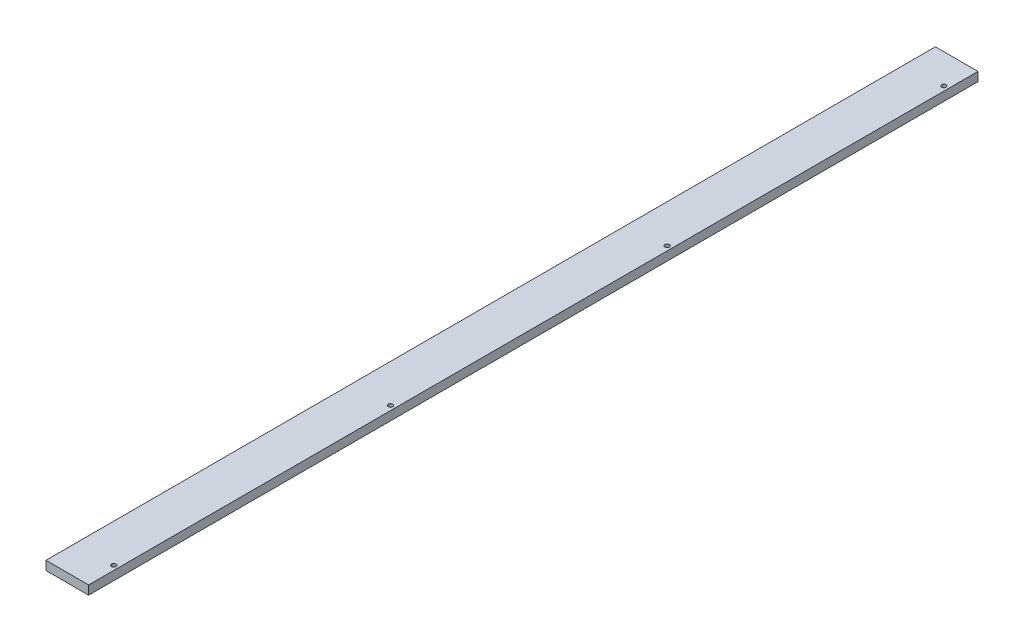
ISO-10303-21;
HEADER;
FILE_DESCRIPTION(('STEP AP214'),'2;1');
FILE_NAME('part.step','',(''),(''),'','','');
FILE_SCHEMA(('AUTOMOTIVE_DESIGN { 1 0 10303 214 1 1 1 1 }'));
ENDSEC;
DATA;
#1=APPLICATION_CONTEXT('core data for automotive mechanical design processes');
#2=APPLICATION_PROTOCOL_DEFINITION('international standard','automotive_design',2000,#1);
#3=PRODUCT_CONTEXT('',#1,'mechanical');
#4=PRODUCT('Part','Part','',(#3));
#5=PRODUCT_RELATED_PRODUCT_CATEGORY('part','',(#4));
#6=PRODUCT_DEFINITION_FORMATION('','',#4);
#7=PRODUCT_DEFINITION_CONTEXT('part definition',#1,'design');
#8=PRODUCT_DEFINITION('design','',#6,#7);
#9=PRODUCT_DEFINITION_SHAPE('','',#8);
#10=(LENGTH_UNIT() NAMED_UNIT(*) SI_UNIT(.MILLI.,.METRE.));
#11=(NAMED_UNIT(*) PLANE_ANGLE_UNIT() SI_UNIT($,.RADIAN.));
#12=(NAMED_UNIT(*) SI_UNIT($,.STERADIAN.) SOLID_ANGLE_UNIT());
#13=UNCERTAINTY_MEASURE_WITH_UNIT(LENGTH_MEASURE(1.E-05),#10,'distance_accuracy_value','');
#14=(GEOMETRIC_REPRESENTATION_CONTEXT(3) GLOBAL_UNCERTAINTY_ASSIGNED_CONTEXT((#13)) GLOBAL_UNIT_ASSIGNED_CONTEXT((#10,
#11,#12)) REPRESENTATION_CONTEXT('',''));
#15=CARTESIAN_POINT('',(0.,0.,0.));
#16=DIRECTION('',(0.,0.,1.));
#17=DIRECTION('',(1.,0.,0.));
#18=AXIS2_PLACEMENT_3D('',#15,#16,#17);
#19=CARTESIAN_POINT('',(0.,12.,0.));
#20=DIRECTION('',(0.,0.,-1.));
#21=DIRECTION('',(-1.,0.,0.));
#22=AXIS2_PLACEMENT_3D('',#19,#20,#21);
#23=PLANE('',#22);
#24=DIRECTION('',(1.,0.,0.));
#25=VECTOR('',#24,1.);
#26=CARTESIAN_POINT('',(0.,12.,0.));
#27=LINE('',#26,#25);
#28=CARTESIAN_POINT('',(4.5,12.,0.));
#29=VERTEX_POINT('',#28);
#30=CARTESIAN_POINT('',(62.,12.,0.));
#31=VERTEX_POINT('',#30);
#32=EDGE_CURVE('E88',#29,#31,#27,.T.);
#33=ORIENTED_EDGE('',*,*,#32,.F.);
#34=DIRECTION('',(0.,1.,0.));
#35=VECTOR('',#34,1.);
#36=CARTESIAN_POINT('',(4.5,-8.,0.));
#37=LINE('',#36,#35);
#38=CARTESIAN_POINT('',(4.5,0.,0.));
#39=VERTEX_POINT('',#38);
#40=EDGE_CURVE('E116',#39,#29,#37,.T.);
#41=ORIENTED_EDGE('',*,*,#40,.F.);
#42=DIRECTION('',(1.,0.,0.));
#43=VECTOR('',#42,1.);
#44=CARTESIAN_POINT('',(0.,0.,0.));
#45=LINE('',#44,#43);
#46=CARTESIAN_POINT('',(62.,0.,0.));
#47=VERTEX_POINT('',#46);
#48=EDGE_CURVE('E79',#39,#47,#45,.T.);
#49=ORIENTED_EDGE('',*,*,#48,.T.);
#50=DIRECTION('',(0.,-1.,0.));
#51=VECTOR('',#50,1.);
#52=CARTESIAN_POINT('',(62.,12.,0.));
#53=LINE('',#52,#51);
#54=EDGE_CURVE('E41',#31,#47,#53,.T.);
#55=ORIENTED_EDGE('',*,*,#54,.F.);
#56=EDGE_LOOP('',(#33,#41,#49,#55));
#57=FACE_BOUND('',#56,.T.);
#58=ADVANCED_FACE('F34',(#57),#23,.F.);
#59=CARTESIAN_POINT('',(62.,12.,0.));
#60=DIRECTION('',(-1.,0.,0.));
#61=DIRECTION('',(0.,0.,1.));
#62=AXIS2_PLACEMENT_3D('',#59,#60,#61);
#63=PLANE('',#62);
#64=DIRECTION('',(0.,0.,-1.));
#65=VECTOR('',#64,1.);
#66=CARTESIAN_POINT('',(62.,0.,0.));
#67=LINE('',#66,#65);
#68=CARTESIAN_POINT('',(62.,0.,-1200.));
#69=VERTEX_POINT('',#68);
#70=EDGE_CURVE('E69',#47,#69,#67,.T.);
#71=ORIENTED_EDGE('',*,*,#70,.T.);
#72=DIRECTION('',(0.,-1.,0.));
#73=VECTOR('',#72,1.);
#74=CARTESIAN_POINT('',(62.,12.,-1200.));
#75=LINE('',#74,#73);
#76=CARTESIAN_POINT('',(62.,12.,-1200.));
#77=VERTEX_POINT('',#76);
#78=EDGE_CURVE('E72',#77,#69,#75,.T.);
#79=ORIENTED_EDGE('',*,*,#78,.F.);
#80=DIRECTION('',(0.,0.,-1.));
#81=VECTOR('',#80,1.);
#82=CARTESIAN_POINT('',(62.,12.,0.));
#83=LINE('',#82,#81);
#84=EDGE_CURVE('E56',#31,#77,#83,.T.);
#85=ORIENTED_EDGE('',*,*,#84,.F.);
#86=ORIENTED_EDGE('',*,*,#54,.T.);
#87=EDGE_LOOP('',(#71,#79,#85,#86));
#88=FACE_BOUND('',#87,.T.);
#89=ADVANCED_FACE('F71',(#88),#63,.F.);
#90=CARTESIAN_POINT('',(0.,12.,-1200.));
#91=DIRECTION('',(0.,0.,1.));
#92=DIRECTION('',(1.,0.,0.));
#93=AXIS2_PLACEMENT_3D('',#90,#91,#92);
#94=PLANE('',#93);
#95=DIRECTION('',(-1.,0.,0.));
#96=VECTOR('',#95,1.);
#97=CARTESIAN_POINT('',(0.,0.,-1200.));
#98=LINE('',#97,#96);
#99=CARTESIAN_POINT('',(4.5,0.,-1200.));
#100=VERTEX_POINT('',#99);
#101=EDGE_CURVE('E78',#69,#100,#98,.T.);
#102=ORIENTED_EDGE('',*,*,#101,.T.);
#103=DIRECTION('',(0.,1.,0.));
#104=VECTOR('',#103,1.);
#105=CARTESIAN_POINT('',(4.5,12.,-1200.));
#106=LINE('',#105,#104);
#107=CARTESIAN_POINT('',(4.5,12.,-1200.));
#108=VERTEX_POINT('',#107);
#109=EDGE_CURVE('E47',#100,#108,#106,.T.);
#110=ORIENTED_EDGE('',*,*,#109,.T.);
#111=DIRECTION('',(-1.,0.,0.));
#112=VECTOR('',#111,1.);
#113=CARTESIAN_POINT('',(0.,12.,-1200.));
#114=LINE('',#113,#112);
#115=EDGE_CURVE('E84',#77,#108,#114,.T.);
#116=ORIENTED_EDGE('',*,*,#115,.F.);
#117=ORIENTED_EDGE('',*,*,#78,.T.);
#118=EDGE_LOOP('',(#102,#110,#116,#117));
#119=FACE_BOUND('',#118,.T.);
#120=ADVANCED_FACE('F83',(#119),#94,.F.);
#121=CARTESIAN_POINT('',(0.,12.,-1200.));
#122=DIRECTION('',(0.,-1.,0.));
#123=DIRECTION('',(0.,0.,-1.));
#124=AXIS2_PLACEMENT_3D('',#121,#122,#123);
#125=PLANE('',#124);
#126=CARTESIAN_POINT('',(56.,12.,-1160.));
#127=DIRECTION('',(0.,1.,0.));
#128=DIRECTION('',(0.,0.,1.));
#129=AXIS2_PLACEMENT_3D('',#126,#127,#128);
#130=CIRCLE('',#129,3.);
#131=CARTESIAN_POINT('',(56.,12.,-1157.));
#132=VERTEX_POINT('',#131);
#133=EDGE_CURVE('E107',#132,#132,#130,.T.);
#134=ORIENTED_EDGE('',*,*,#133,.F.);
#135=EDGE_LOOP('',(#134));
#136=FACE_BOUND('',#135,.T.);
#137=CARTESIAN_POINT('',(56.,12.,-786.666666666667));
#138=DIRECTION('',(0.,1.,0.));
#139=DIRECTION('',(0.,0.,1.));
#140=AXIS2_PLACEMENT_3D('',#137,#138,#139);
#141=CIRCLE('',#140,3.);
#142=CARTESIAN_POINT('',(56.,12.,-783.666666666667));
#143=VERTEX_POINT('',#142);
#144=EDGE_CURVE('E104',#143,#143,#141,.T.);
#145=ORIENTED_EDGE('',*,*,#144,.F.);
#146=EDGE_LOOP('',(#145));
#147=FACE_BOUND('',#146,.T.);
#148=CARTESIAN_POINT('',(56.,12.,-413.333333333333));
#149=DIRECTION('',(0.,1.,0.));
#150=DIRECTION('',(0.,0.,1.));
#151=AXIS2_PLACEMENT_3D('',#148,#149,#150);
#152=CIRCLE('',#151,3.);
#153=CARTESIAN_POINT('',(56.,12.,-410.333333333333));
#154=VERTEX_POINT('',#153);
#155=EDGE_CURVE('E101',#154,#154,#152,.T.);
#156=ORIENTED_EDGE('',*,*,#155,.F.);
#157=EDGE_LOOP('',(#156));
#158=FACE_BOUND('',#157,.T.);
#159=CARTESIAN_POINT('',(56.,12.,-40.));
#160=DIRECTION('',(0.,1.,0.));
#161=DIRECTION('',(0.,0.,1.));
#162=AXIS2_PLACEMENT_3D('',#159,#160,#161);
#163=CIRCLE('',#162,3.);
#164=CARTESIAN_POINT('',(56.,12.,-37.));
#165=VERTEX_POINT('',#164);
#166=EDGE_CURVE('E97',#165,#165,#163,.T.);
#167=ORIENTED_EDGE('',*,*,#166,.F.);
#168=EDGE_LOOP('',(#167));
#169=FACE_BOUND('',#168,.T.);
#170=ORIENTED_EDGE('',*,*,#115,.T.);
#171=DIRECTION('',(0.,0.,-1.));
#172=VECTOR('',#171,1.);
#173=CARTESIAN_POINT('',(4.5,12.,0.));
#174=LINE('',#173,#172);
#175=EDGE_CURVE('E135',#29,#108,#174,.T.);
#176=ORIENTED_EDGE('',*,*,#175,.F.);
#177=ORIENTED_EDGE('',*,*,#32,.T.);
#178=ORIENTED_EDGE('',*,*,#84,.T.);
#179=EDGE_LOOP('',(#170,#176,#177,#178));
#180=FACE_BOUND('',#179,.T.);
#181=ADVANCED_FACE('F136',(#136,#147,#158,#169,#180),#125,.F.);
#182=CARTESIAN_POINT('',(0.,0.,-1200.));
#183=DIRECTION('',(0.,-1.,0.));
#184=DIRECTION('',(0.,0.,-1.));
#185=AXIS2_PLACEMENT_3D('',#182,#183,#184);
#186=PLANE('',#185);
#187=DIRECTION('',(0.,0.,1.));
#188=VECTOR('',#187,1.);
#189=CARTESIAN_POINT('',(4.5,0.,-1200.));
#190=LINE('',#189,#188);
#191=EDGE_CURVE('E11',#100,#39,#190,.T.);
#192=ORIENTED_EDGE('',*,*,#191,.F.);
#193=ORIENTED_EDGE('',*,*,#101,.F.);
#194=ORIENTED_EDGE('',*,*,#70,.F.);
#195=ORIENTED_EDGE('',*,*,#48,.F.);
#196=EDGE_LOOP('',(#192,#193,#194,#195));
#197=FACE_BOUND('',#196,.T.);
#198=CARTESIAN_POINT('',(56.,0.,-1160.));
#199=DIRECTION('',(0.,-1.,0.));
#200=DIRECTION('',(0.,0.,-1.));
#201=AXIS2_PLACEMENT_3D('',#198,#199,#200);
#202=CIRCLE('',#201,3.);
#203=CARTESIAN_POINT('',(56.,0.,-1163.));
#204=VERTEX_POINT('',#203);
#205=EDGE_CURVE('E105',#204,#204,#202,.T.);
#206=ORIENTED_EDGE('',*,*,#205,.F.);
#207=EDGE_LOOP('',(#206));
#208=FACE_BOUND('',#207,.T.);
#209=CARTESIAN_POINT('',(56.,0.,-786.666666666667));
#210=DIRECTION('',(0.,-1.,0.));
#211=DIRECTION('',(0.,0.,-1.));
#212=AXIS2_PLACEMENT_3D('',#209,#210,#211);
#213=CIRCLE('',#212,3.);
#214=CARTESIAN_POINT('',(56.,0.,-789.666666666667));
#215=VERTEX_POINT('',#214);
#216=EDGE_CURVE('E102',#215,#215,#213,.T.);
#217=ORIENTED_EDGE('',*,*,#216,.F.);
#218=EDGE_LOOP('',(#217));
#219=FACE_BOUND('',#218,.T.);
#220=CARTESIAN_POINT('',(56.,0.,-413.333333333333));
#221=DIRECTION('',(0.,-1.,0.));
#222=DIRECTION('',(0.,0.,-1.));
#223=AXIS2_PLACEMENT_3D('',#220,#221,#222);
#224=CIRCLE('',#223,3.);
#225=CARTESIAN_POINT('',(56.,0.,-416.333333333333));
#226=VERTEX_POINT('',#225);
#227=EDGE_CURVE('E98',#226,#226,#224,.T.);
#228=ORIENTED_EDGE('',*,*,#227,.F.);
#229=EDGE_LOOP('',(#228));
#230=FACE_BOUND('',#229,.T.);
#231=CARTESIAN_POINT('',(56.,0.,-40.));
#232=DIRECTION('',(0.,-1.,0.));
#233=DIRECTION('',(0.,0.,-1.));
#234=AXIS2_PLACEMENT_3D('',#231,#232,#233);
#235=CIRCLE('',#234,3.);
#236=CARTESIAN_POINT('',(56.,0.,-43.));
#237=VERTEX_POINT('',#236);
#238=EDGE_CURVE('E94',#237,#237,#235,.T.);
#239=ORIENTED_EDGE('',*,*,#238,.F.);
#240=EDGE_LOOP('',(#239));
#241=FACE_BOUND('',#240,.T.);
#242=ADVANCED_FACE('F86',(#197,#208,#219,#230,#241),#186,.T.);
#243=CARTESIAN_POINT('',(56.,-10.,-40.));
#244=DIRECTION('',(0.,1.,0.));
#245=DIRECTION('',(0.,0.,1.));
#246=AXIS2_PLACEMENT_3D('',#243,#244,#245);
#247=CYLINDRICAL_SURFACE('',#246,3.);
#248=ORIENTED_EDGE('',*,*,#238,.T.);
#249=EDGE_LOOP('',(#248));
#250=FACE_BOUND('',#249,.T.);
#251=ORIENTED_EDGE('',*,*,#166,.T.);
#252=EDGE_LOOP('',(#251));
#253=FACE_BOUND('',#252,.T.);
#254=ADVANCED_FACE('F145',(#250,#253),#247,.F.);
#255=CARTESIAN_POINT('',(56.,-10.,-413.333333333333));
#256=DIRECTION('',(0.,1.,0.));
#257=DIRECTION('',(0.,0.,1.));
#258=AXIS2_PLACEMENT_3D('',#255,#256,#257);
#259=CYLINDRICAL_SURFACE('',#258,3.);
#260=ORIENTED_EDGE('',*,*,#227,.T.);
#261=EDGE_LOOP('',(#260));
#262=FACE_BOUND('',#261,.T.);
#263=ORIENTED_EDGE('',*,*,#155,.T.);
#264=EDGE_LOOP('',(#263));
#265=FACE_BOUND('',#264,.T.);
#266=ADVANCED_FACE('F183',(#262,#265),#259,.F.);
#267=CARTESIAN_POINT('',(56.,-10.,-786.666666666667));
#268=DIRECTION('',(0.,1.,0.));
#269=DIRECTION('',(0.,0.,1.));
#270=AXIS2_PLACEMENT_3D('',#267,#268,#269);
#271=CYLINDRICAL_SURFACE('',#270,3.);
#272=ORIENTED_EDGE('',*,*,#216,.T.);
#273=EDGE_LOOP('',(#272));
#274=FACE_BOUND('',#273,.T.);
#275=ORIENTED_EDGE('',*,*,#144,.T.);
#276=EDGE_LOOP('',(#275));
#277=FACE_BOUND('',#276,.T.);
#278=ADVANCED_FACE('F189',(#274,#277),#271,.F.);
#279=CARTESIAN_POINT('',(56.,-10.,-1160.));
#280=DIRECTION('',(0.,1.,0.));
#281=DIRECTION('',(0.,0.,1.));
#282=AXIS2_PLACEMENT_3D('',#279,#280,#281);
#283=CYLINDRICAL_SURFACE('',#282,3.);
#284=ORIENTED_EDGE('',*,*,#205,.T.);
#285=EDGE_LOOP('',(#284));
#286=FACE_BOUND('',#285,.T.);
#287=ORIENTED_EDGE('',*,*,#133,.T.);
#288=EDGE_LOOP('',(#287));
#289=FACE_BOUND('',#288,.T.);
#290=ADVANCED_FACE('F197',(#286,#289),#283,.F.);
#291=CARTESIAN_POINT('',(4.5,-8.,0.));
#292=DIRECTION('',(1.,0.,0.));
#293=DIRECTION('',(0.,0.,-1.));
#294=AXIS2_PLACEMENT_3D('',#291,#292,#293);
#295=PLANE('',#294);
#296=ORIENTED_EDGE('',*,*,#191,.T.);
#297=ORIENTED_EDGE('',*,*,#40,.T.);
#298=ORIENTED_EDGE('',*,*,#175,.T.);
#299=ORIENTED_EDGE('',*,*,#109,.F.);
#300=EDGE_LOOP('',(#296,#297,#298,#299));
#301=FACE_BOUND('',#300,.T.);
#302=ADVANCED_FACE('F134',(#301),#295,.F.);
#303=CLOSED_SHELL('',(#58,#89,#120,#181,#242,#254,#266,#278,#290,#302));
#304=MANIFOLD_SOLID_BREP('B2',#303);
#305=ADVANCED_BREP_SHAPE_REPRESENTATION('',(#18,#304),#14);
#306=SHAPE_DEFINITION_REPRESENTATION(#9,#305);
ENDSEC;
END-ISO-10303-21;
